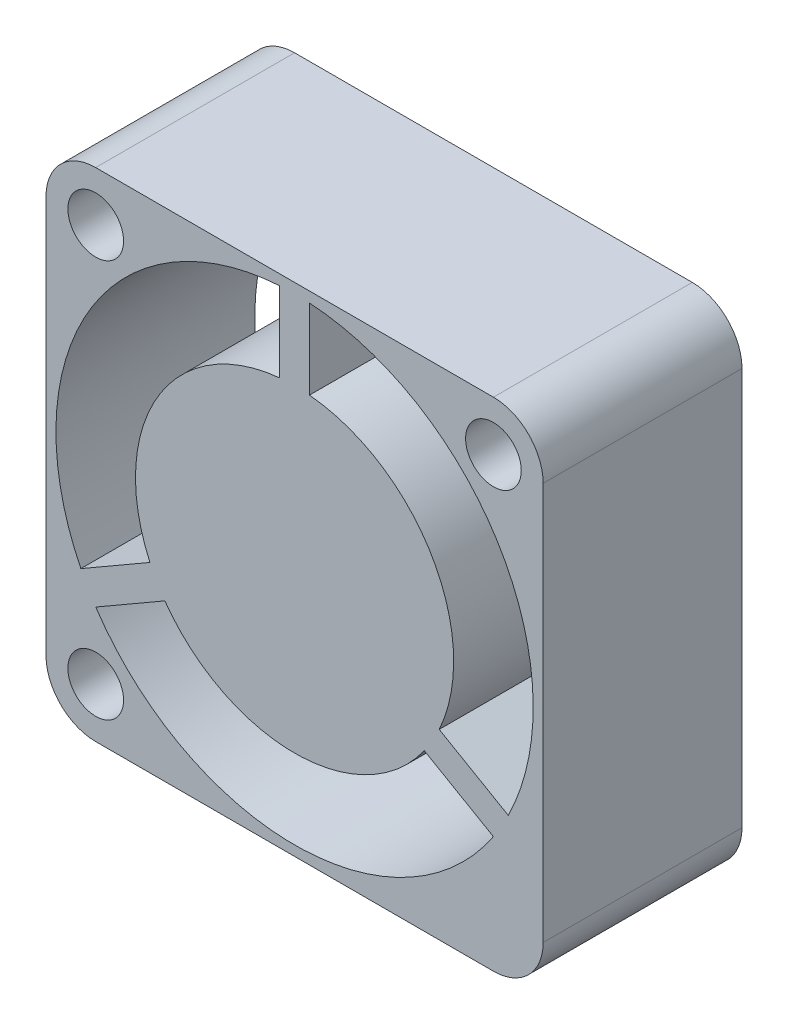
ISO-10303-21;
HEADER;
FILE_DESCRIPTION(('STEP AP214'),'2;1');
FILE_NAME('part.step','',(''),(''),'','','');
FILE_SCHEMA(('AUTOMOTIVE_DESIGN { 1 0 10303 214 1 1 1 1 }'));
ENDSEC;
DATA;
#1=APPLICATION_CONTEXT('core data for automotive mechanical design processes');
#2=APPLICATION_PROTOCOL_DEFINITION('international standard','automotive_design',2000,#1);
#3=PRODUCT_CONTEXT('',#1,'mechanical');
#4=PRODUCT('Part','Part','',(#3));
#5=PRODUCT_RELATED_PRODUCT_CATEGORY('part','',(#4));
#6=PRODUCT_DEFINITION_FORMATION('','',#4);
#7=PRODUCT_DEFINITION_CONTEXT('part definition',#1,'design');
#8=PRODUCT_DEFINITION('design','',#6,#7);
#9=PRODUCT_DEFINITION_SHAPE('','',#8);
#10=(LENGTH_UNIT() NAMED_UNIT(*) SI_UNIT(.MILLI.,.METRE.));
#11=(NAMED_UNIT(*) PLANE_ANGLE_UNIT() SI_UNIT($,.RADIAN.));
#12=(NAMED_UNIT(*) SI_UNIT($,.STERADIAN.) SOLID_ANGLE_UNIT());
#13=UNCERTAINTY_MEASURE_WITH_UNIT(LENGTH_MEASURE(1.E-05),#10,'distance_accuracy_value','');
#14=(GEOMETRIC_REPRESENTATION_CONTEXT(3) GLOBAL_UNCERTAINTY_ASSIGNED_CONTEXT((#13)) GLOBAL_UNIT_ASSIGNED_CONTEXT((#10,
#11,#12)) REPRESENTATION_CONTEXT('',''));
#15=CARTESIAN_POINT('',(0.,0.,0.));
#16=DIRECTION('',(0.,0.,1.));
#17=DIRECTION('',(1.,0.,0.));
#18=AXIS2_PLACEMENT_3D('',#15,#16,#17);
#19=CARTESIAN_POINT('',(12.5,12.5,10.));
#20=DIRECTION('',(0.,0.,-1.));
#21=DIRECTION('',(-1.,0.,0.));
#22=AXIS2_PLACEMENT_3D('',#19,#20,#21);
#23=CYLINDRICAL_SURFACE('',#22,12.);
#24=DIRECTION('',(0.,0.,-1.));
#25=VECTOR('',#24,1.);
#26=CARTESIAN_POINT('',(1.7530124855456,7.16124926933639,10.));
#27=LINE('',#26,#25);
#28=CARTESIAN_POINT('',(1.7530124855456,7.16124926933639,0.));
#29=VERTEX_POINT('',#28);
#30=CARTESIAN_POINT('',(1.7530124855456,7.16124926933639,10.));
#31=VERTEX_POINT('',#30);
#32=EDGE_CURVE('E195',#29,#31,#27,.F.);
#33=ORIENTED_EDGE('',*,*,#32,.F.);
#34=CARTESIAN_POINT('',(12.5,12.5,0.));
#35=DIRECTION('',(0.,0.,1.));
#36=DIRECTION('',(1.,0.,0.));
#37=AXIS2_PLACEMENT_3D('',#34,#35,#36);
#38=CIRCLE('',#37,12.);
#39=CARTESIAN_POINT('',(11.75,24.4765395670035,0.));
#40=VERTEX_POINT('',#39);
#41=EDGE_CURVE('E270',#40,#29,#38,.T.);
#42=ORIENTED_EDGE('',*,*,#41,.F.);
#43=DIRECTION('',(0.,0.,-1.));
#44=VECTOR('',#43,1.);
#45=CARTESIAN_POINT('',(11.75,24.4765395670035,10.));
#46=LINE('',#45,#44);
#47=CARTESIAN_POINT('',(11.75,24.4765395670035,10.));
#48=VERTEX_POINT('',#47);
#49=EDGE_CURVE('E40',#48,#40,#46,.T.);
#50=ORIENTED_EDGE('',*,*,#49,.F.);
#51=CARTESIAN_POINT('',(12.5,12.5,10.));
#52=DIRECTION('',(0.,0.,1.));
#53=DIRECTION('',(1.,0.,0.));
#54=AXIS2_PLACEMENT_3D('',#51,#52,#53);
#55=CIRCLE('',#54,12.);
#56=EDGE_CURVE('E266',#48,#31,#55,.T.);
#57=ORIENTED_EDGE('',*,*,#56,.T.);
#58=EDGE_LOOP('',(#33,#42,#50,#57));
#59=FACE_BOUND('',#58,.T.);
#60=ADVANCED_FACE('F32',(#59),#23,.F.);
#61=CARTESIAN_POINT('',(12.5,12.5,-22.6274169979695));
#62=DIRECTION('',(0.,0.,1.));
#63=DIRECTION('',(1.,0.,0.));
#64=AXIS2_PLACEMENT_3D('',#61,#62,#63);
#65=CYLINDRICAL_SURFACE('',#64,8.);
#66=DIRECTION('',(0.,0.,1.));
#67=VECTOR('',#66,1.);
#68=CARTESIAN_POINT('',(5.22731016933961,9.16713597231971,-5.88228094568846));
#69=LINE('',#68,#67);
#70=CARTESIAN_POINT('',(5.22731016933941,9.16713597231959,0.));
#71=VERTEX_POINT('',#70);
#72=CARTESIAN_POINT('',(5.22731016933941,9.16713597231959,10.));
#73=VERTEX_POINT('',#72);
#74=EDGE_CURVE('E47',#71,#73,#69,.T.);
#75=ORIENTED_EDGE('',*,*,#74,.T.);
#76=CARTESIAN_POINT('',(12.5,12.5,10.));
#77=DIRECTION('',(0.,0.,1.));
#78=DIRECTION('',(1.,0.,0.));
#79=AXIS2_PLACEMENT_3D('',#76,#77,#78);
#80=CIRCLE('',#79,8.);
#81=CARTESIAN_POINT('',(11.75,20.464766161037,10.));
#82=VERTEX_POINT('',#81);
#83=EDGE_CURVE('E179',#82,#73,#80,.T.);
#84=ORIENTED_EDGE('',*,*,#83,.F.);
#85=DIRECTION('',(0.,0.,1.));
#86=VECTOR('',#85,1.);
#87=CARTESIAN_POINT('',(11.75,20.464766161037,-5.88228094568846));
#88=LINE('',#87,#86);
#89=CARTESIAN_POINT('',(11.75,20.464766161037,0.));
#90=VERTEX_POINT('',#89);
#91=EDGE_CURVE('E239',#90,#82,#88,.T.);
#92=ORIENTED_EDGE('',*,*,#91,.F.);
#93=CARTESIAN_POINT('',(12.5,12.5,0.));
#94=DIRECTION('',(0.,0.,-1.));
#95=DIRECTION('',(-1.,0.,0.));
#96=AXIS2_PLACEMENT_3D('',#93,#94,#95);
#97=CIRCLE('',#96,8.);
#98=EDGE_CURVE('E226',#90,#71,#97,.F.);
#99=ORIENTED_EDGE('',*,*,#98,.T.);
#100=EDGE_LOOP('',(#75,#84,#92,#99));
#101=FACE_BOUND('',#100,.T.);
#102=ADVANCED_FACE('F345',(#101),#65,.T.);
#103=DIRECTION('',(0.,0.,-1.));
#104=VECTOR('',#103,1.);
#105=CARTESIAN_POINT('',(2.50301248554563,5.86221116365974,10.));
#106=LINE('',#105,#104);
#107=CARTESIAN_POINT('',(2.50301248554563,5.86221116365974,10.));
#108=VERTEX_POINT('',#107);
#109=CARTESIAN_POINT('',(2.50301248554563,5.86221116365974,0.));
#110=VERTEX_POINT('',#109);
#111=EDGE_CURVE('E55',#108,#110,#106,.T.);
#112=ORIENTED_EDGE('',*,*,#111,.F.);
#113=CARTESIAN_POINT('',(22.4969875144547,5.86221116366016,10.));
#114=VERTEX_POINT('',#113);
#115=EDGE_CURVE('E186',#108,#114,#55,.T.);
#116=ORIENTED_EDGE('',*,*,#115,.T.);
#117=DIRECTION('',(0.,0.,-1.));
#118=VECTOR('',#117,1.);
#119=CARTESIAN_POINT('',(22.4969875144547,5.86221116366017,10.));
#120=LINE('',#119,#118);
#121=CARTESIAN_POINT('',(22.4969875144547,5.86221116366016,0.));
#122=VERTEX_POINT('',#121);
#123=EDGE_CURVE('E222',#122,#114,#120,.F.);
#124=ORIENTED_EDGE('',*,*,#123,.F.);
#125=EDGE_CURVE('E273',#110,#122,#38,.T.);
#126=ORIENTED_EDGE('',*,*,#125,.F.);
#127=EDGE_LOOP('',(#112,#116,#124,#126));
#128=FACE_BOUND('',#127,.T.);
#129=ADVANCED_FACE('F365',(#128),#23,.F.);
#130=DIRECTION('',(0.,0.,1.));
#131=VECTOR('',#130,1.);
#132=CARTESIAN_POINT('',(5.9773101693396,7.86809786664304,-5.88228094568846));
#133=LINE('',#132,#131);
#134=CARTESIAN_POINT('',(5.97731016933945,7.86809786664296,0.));
#135=VERTEX_POINT('',#134);
#136=CARTESIAN_POINT('',(5.9773101693396,7.86809786664304,10.));
#137=VERTEX_POINT('',#136);
#138=EDGE_CURVE('E172',#135,#137,#133,.T.);
#139=ORIENTED_EDGE('',*,*,#138,.F.);
#140=CARTESIAN_POINT('',(19.0226898306609,7.86809786664342,0.));
#141=VERTEX_POINT('',#140);
#142=EDGE_CURVE('E229',#135,#141,#97,.F.);
#143=ORIENTED_EDGE('',*,*,#142,.T.);
#144=DIRECTION('',(0.,0.,1.));
#145=VECTOR('',#144,1.);
#146=CARTESIAN_POINT('',(19.022689830661,7.86809786664334,-5.88228094568846));
#147=LINE('',#146,#145);
#148=CARTESIAN_POINT('',(19.0226898306609,7.86809786664342,10.));
#149=VERTEX_POINT('',#148);
#150=EDGE_CURVE('E175',#141,#149,#147,.T.);
#151=ORIENTED_EDGE('',*,*,#150,.T.);
#152=EDGE_CURVE('E168',#137,#149,#80,.T.);
#153=ORIENTED_EDGE('',*,*,#152,.F.);
#154=EDGE_LOOP('',(#139,#143,#151,#153));
#155=FACE_BOUND('',#154,.T.);
#156=ADVANCED_FACE('F170',(#155),#65,.T.);
#157=CARTESIAN_POINT('',(0.,0.,10.));
#158=DIRECTION('',(0.,0.,-1.));
#159=DIRECTION('',(-1.,0.,0.));
#160=AXIS2_PLACEMENT_3D('',#157,#158,#159);
#161=PLANE('',#160);
#162=ORIENTED_EDGE('',*,*,#115,.F.);
#163=DIRECTION('',(0.866025403784443,0.499999999999992,0.));
#164=VECTOR('',#163,1.);
#165=CARTESIAN_POINT('',(2.04968245269479,5.60048094716158,10.));
#166=LINE('',#165,#164);
#167=EDGE_CURVE('E183',#108,#137,#166,.T.);
#168=ORIENTED_EDGE('',*,*,#167,.T.);
#169=ORIENTED_EDGE('',*,*,#152,.T.);
#170=DIRECTION('',(0.866025403784436,-0.500000000000004,0.));
#171=VECTOR('',#170,1.);
#172=CARTESIAN_POINT('',(22.9503175473058,5.60048094716182,10.));
#173=LINE('',#172,#171);
#174=EDGE_CURVE('E205',#149,#114,#173,.T.);
#175=ORIENTED_EDGE('',*,*,#174,.T.);
#176=EDGE_LOOP('',(#162,#168,#169,#175));
#177=FACE_BOUND('',#176,.T.);
#178=DIRECTION('',(-0.866025403784444,-0.499999999999992,0.));
#179=VECTOR('',#178,1.);
#180=CARTESIAN_POINT('',(1.2996824526948,6.89951905283824,10.));
#181=LINE('',#180,#179);
#182=EDGE_CURVE('E188',#73,#31,#181,.T.);
#183=ORIENTED_EDGE('',*,*,#182,.T.);
#184=ORIENTED_EDGE('',*,*,#56,.F.);
#185=DIRECTION('',(0.,-1.,0.));
#186=VECTOR('',#185,1.);
#187=CARTESIAN_POINT('',(11.75,25.,10.));
#188=LINE('',#187,#186);
#189=EDGE_CURVE('E228',#48,#82,#188,.T.);
#190=ORIENTED_EDGE('',*,*,#189,.T.);
#191=ORIENTED_EDGE('',*,*,#83,.T.);
#192=EDGE_LOOP('',(#183,#184,#190,#191));
#193=FACE_BOUND('',#192,.T.);
#194=DIRECTION('',(-0.866025403784436,0.500000000000004,0.));
#195=VECTOR('',#194,1.);
#196=CARTESIAN_POINT('',(23.7003175473058,6.89951905283848,10.));
#197=LINE('',#196,#195);
#198=CARTESIAN_POINT('',(23.2469875144546,7.16124926933684,10.));
#199=VERTEX_POINT('',#198);
#200=CARTESIAN_POINT('',(19.772689830661,9.16713597232,10.));
#201=VERTEX_POINT('',#200);
#202=EDGE_CURVE('E204',#199,#201,#197,.T.);
#203=ORIENTED_EDGE('',*,*,#202,.T.);
#204=CARTESIAN_POINT('',(13.25,20.464766161037,10.));
#205=VERTEX_POINT('',#204);
#206=EDGE_CURVE('E180',#201,#205,#80,.T.);
#207=ORIENTED_EDGE('',*,*,#206,.T.);
#208=DIRECTION('',(0.,1.,0.));
#209=VECTOR('',#208,1.);
#210=CARTESIAN_POINT('',(13.25,25.,10.));
#211=LINE('',#210,#209);
#212=CARTESIAN_POINT('',(13.25,24.4765395670035,10.));
#213=VERTEX_POINT('',#212);
#214=EDGE_CURVE('E230',#205,#213,#211,.T.);
#215=ORIENTED_EDGE('',*,*,#214,.T.);
#216=EDGE_CURVE('E269',#199,#213,#55,.T.);
#217=ORIENTED_EDGE('',*,*,#216,.F.);
#218=EDGE_LOOP('',(#203,#207,#215,#217));
#219=FACE_BOUND('',#218,.T.);
#220=CARTESIAN_POINT('',(2.5,2.5,10.));
#221=DIRECTION('',(0.,0.,1.));
#222=DIRECTION('',(1.,0.,0.));
#223=AXIS2_PLACEMENT_3D('',#220,#221,#222);
#224=CIRCLE('',#223,1.4);
#225=CARTESIAN_POINT('',(3.9,2.5,10.));
#226=VERTEX_POINT('',#225);
#227=EDGE_CURVE('E254',#226,#226,#224,.T.);
#228=ORIENTED_EDGE('',*,*,#227,.F.);
#229=EDGE_LOOP('',(#228));
#230=FACE_BOUND('',#229,.T.);
#231=DIRECTION('',(-1.,0.,0.));
#232=VECTOR('',#231,1.);
#233=CARTESIAN_POINT('',(0.,25.,10.));
#234=LINE('',#233,#232);
#235=CARTESIAN_POINT('',(22.5,25.,10.));
#236=VERTEX_POINT('',#235);
#237=CARTESIAN_POINT('',(2.5,25.,10.));
#238=VERTEX_POINT('',#237);
#239=EDGE_CURVE('E284',#236,#238,#234,.T.);
#240=ORIENTED_EDGE('',*,*,#239,.T.);
#241=CARTESIAN_POINT('',(2.5,22.5,10.));
#242=DIRECTION('',(0.,0.,-1.));
#243=DIRECTION('',(-1.,0.,0.));
#244=AXIS2_PLACEMENT_3D('',#241,#242,#243);
#245=CIRCLE('',#244,2.5);
#246=CARTESIAN_POINT('',(0.,22.5,10.));
#247=VERTEX_POINT('',#246);
#248=EDGE_CURVE('E321',#238,#247,#245,.F.);
#249=ORIENTED_EDGE('',*,*,#248,.T.);
#250=DIRECTION('',(0.,-1.,0.));
#251=VECTOR('',#250,1.);
#252=CARTESIAN_POINT('',(0.,0.,10.));
#253=LINE('',#252,#251);
#254=CARTESIAN_POINT('',(0.,2.5,10.));
#255=VERTEX_POINT('',#254);
#256=EDGE_CURVE('E274',#247,#255,#253,.T.);
#257=ORIENTED_EDGE('',*,*,#256,.T.);
#258=CARTESIAN_POINT('',(2.5,2.5,10.));
#259=DIRECTION('',(0.,0.,-1.));
#260=DIRECTION('',(-1.,0.,0.));
#261=AXIS2_PLACEMENT_3D('',#258,#259,#260);
#262=CIRCLE('',#261,2.5);
#263=CARTESIAN_POINT('',(2.5,0.,10.));
#264=VERTEX_POINT('',#263);
#265=EDGE_CURVE('E319',#255,#264,#262,.F.);
#266=ORIENTED_EDGE('',*,*,#265,.T.);
#267=DIRECTION('',(1.,0.,0.));
#268=VECTOR('',#267,1.);
#269=CARTESIAN_POINT('',(0.,0.,10.));
#270=LINE('',#269,#268);
#271=CARTESIAN_POINT('',(22.5,0.,10.));
#272=VERTEX_POINT('',#271);
#273=EDGE_CURVE('E277',#264,#272,#270,.T.);
#274=ORIENTED_EDGE('',*,*,#273,.T.);
#275=CARTESIAN_POINT('',(22.5,2.5,10.));
#276=DIRECTION('',(0.,0.,-1.));
#277=DIRECTION('',(-1.,0.,0.));
#278=AXIS2_PLACEMENT_3D('',#275,#276,#277);
#279=CIRCLE('',#278,2.5);
#280=CARTESIAN_POINT('',(25.,2.5,10.));
#281=VERTEX_POINT('',#280);
#282=EDGE_CURVE('E317',#272,#281,#279,.F.);
#283=ORIENTED_EDGE('',*,*,#282,.T.);
#284=DIRECTION('',(0.,1.,0.));
#285=VECTOR('',#284,1.);
#286=CARTESIAN_POINT('',(25.,0.,10.));
#287=LINE('',#286,#285);
#288=CARTESIAN_POINT('',(25.,22.5,10.));
#289=VERTEX_POINT('',#288);
#290=EDGE_CURVE('E281',#281,#289,#287,.T.);
#291=ORIENTED_EDGE('',*,*,#290,.T.);
#292=CARTESIAN_POINT('',(22.5,22.5,10.));
#293=DIRECTION('',(0.,0.,-1.));
#294=DIRECTION('',(-1.,0.,0.));
#295=AXIS2_PLACEMENT_3D('',#292,#293,#294);
#296=CIRCLE('',#295,2.5);
#297=EDGE_CURVE('E315',#289,#236,#296,.F.);
#298=ORIENTED_EDGE('',*,*,#297,.T.);
#299=EDGE_LOOP('',(#240,#249,#257,#266,#274,#283,#291,#298));
#300=FACE_BOUND('',#299,.T.);
#301=CARTESIAN_POINT('',(2.5,22.5,10.));
#302=DIRECTION('',(0.,0.,1.));
#303=DIRECTION('',(1.,0.,0.));
#304=AXIS2_PLACEMENT_3D('',#301,#302,#303);
#305=CIRCLE('',#304,1.4);
#306=CARTESIAN_POINT('',(3.9,22.5,10.));
#307=VERTEX_POINT('',#306);
#308=EDGE_CURVE('E260',#307,#307,#305,.T.);
#309=ORIENTED_EDGE('',*,*,#308,.F.);
#310=EDGE_LOOP('',(#309));
#311=FACE_BOUND('',#310,.T.);
#312=CARTESIAN_POINT('',(22.5,22.5,10.));
#313=DIRECTION('',(0.,0.,1.));
#314=DIRECTION('',(1.,0.,0.));
#315=AXIS2_PLACEMENT_3D('',#312,#313,#314);
#316=CIRCLE('',#315,1.4);
#317=CARTESIAN_POINT('',(23.9,22.5,10.));
#318=VERTEX_POINT('',#317);
#319=EDGE_CURVE('E248',#318,#318,#316,.T.);
#320=ORIENTED_EDGE('',*,*,#319,.F.);
#321=EDGE_LOOP('',(#320));
#322=FACE_BOUND('',#321,.T.);
#323=ADVANCED_FACE('F184',(#177,#193,#219,#230,#300,#311,#322),#161,.F.);
#324=CARTESIAN_POINT('',(0.,0.,0.));
#325=DIRECTION('',(0.,0.,-1.));
#326=DIRECTION('',(-1.,0.,0.));
#327=AXIS2_PLACEMENT_3D('',#324,#325,#326);
#328=PLANE('',#327);
#329=DIRECTION('',(0.866025403784443,0.499999999999992,0.));
#330=VECTOR('',#329,1.);
#331=CARTESIAN_POINT('',(2.04968245269479,5.60048094716158,0.));
#332=LINE('',#331,#330);
#333=EDGE_CURVE('E193',#110,#135,#332,.T.);
#334=ORIENTED_EDGE('',*,*,#333,.F.);
#335=ORIENTED_EDGE('',*,*,#125,.T.);
#336=DIRECTION('',(0.866025403784436,-0.500000000000004,0.));
#337=VECTOR('',#336,1.);
#338=CARTESIAN_POINT('',(22.9503175473058,5.60048094716182,0.));
#339=LINE('',#338,#337);
#340=EDGE_CURVE('E213',#141,#122,#339,.T.);
#341=ORIENTED_EDGE('',*,*,#340,.F.);
#342=ORIENTED_EDGE('',*,*,#142,.F.);
#343=EDGE_LOOP('',(#334,#335,#341,#342));
#344=FACE_BOUND('',#343,.T.);
#345=ORIENTED_EDGE('',*,*,#41,.T.);
#346=DIRECTION('',(-0.866025403784444,-0.499999999999992,0.));
#347=VECTOR('',#346,1.);
#348=CARTESIAN_POINT('',(1.2996824526948,6.89951905283824,0.));
#349=LINE('',#348,#347);
#350=EDGE_CURVE('E197',#71,#29,#349,.T.);
#351=ORIENTED_EDGE('',*,*,#350,.F.);
#352=ORIENTED_EDGE('',*,*,#98,.F.);
#353=DIRECTION('',(0.,-1.,0.));
#354=VECTOR('',#353,1.);
#355=CARTESIAN_POINT('',(11.75,25.,0.));
#356=LINE('',#355,#354);
#357=EDGE_CURVE('E236',#40,#90,#356,.T.);
#358=ORIENTED_EDGE('',*,*,#357,.F.);
#359=EDGE_LOOP('',(#345,#351,#352,#358));
#360=FACE_BOUND('',#359,.T.);
#361=CARTESIAN_POINT('',(19.7726898306608,9.16713597232011,0.));
#362=VERTEX_POINT('',#361);
#363=CARTESIAN_POINT('',(13.25,20.464766161037,0.));
#364=VERTEX_POINT('',#363);
#365=EDGE_CURVE('E225',#362,#364,#97,.F.);
#366=ORIENTED_EDGE('',*,*,#365,.F.);
#367=DIRECTION('',(-0.866025403784436,0.500000000000004,0.));
#368=VECTOR('',#367,1.);
#369=CARTESIAN_POINT('',(23.7003175473058,6.89951905283848,0.));
#370=LINE('',#369,#368);
#371=CARTESIAN_POINT('',(23.2469875144546,7.16124926933685,0.));
#372=VERTEX_POINT('',#371);
#373=EDGE_CURVE('E209',#372,#362,#370,.T.);
#374=ORIENTED_EDGE('',*,*,#373,.F.);
#375=CARTESIAN_POINT('',(13.25,24.4765395670035,0.));
#376=VERTEX_POINT('',#375);
#377=EDGE_CURVE('E263',#372,#376,#38,.T.);
#378=ORIENTED_EDGE('',*,*,#377,.T.);
#379=DIRECTION('',(0.,1.,0.));
#380=VECTOR('',#379,1.);
#381=CARTESIAN_POINT('',(13.25,25.,0.));
#382=LINE('',#381,#380);
#383=EDGE_CURVE('E240',#364,#376,#382,.T.);
#384=ORIENTED_EDGE('',*,*,#383,.F.);
#385=EDGE_LOOP('',(#366,#374,#378,#384));
#386=FACE_BOUND('',#385,.T.);
#387=CARTESIAN_POINT('',(2.5,22.5,0.));
#388=DIRECTION('',(0.,0.,-1.));
#389=DIRECTION('',(-1.,0.,0.));
#390=AXIS2_PLACEMENT_3D('',#387,#388,#389);
#391=CIRCLE('',#390,2.5);
#392=CARTESIAN_POINT('',(0.,22.5,0.));
#393=VERTEX_POINT('',#392);
#394=CARTESIAN_POINT('',(2.5,25.,0.));
#395=VERTEX_POINT('',#394);
#396=EDGE_CURVE('E306',#393,#395,#391,.T.);
#397=ORIENTED_EDGE('',*,*,#396,.T.);
#398=DIRECTION('',(-1.,0.,0.));
#399=VECTOR('',#398,1.);
#400=CARTESIAN_POINT('',(0.,25.,0.));
#401=LINE('',#400,#399);
#402=CARTESIAN_POINT('',(22.5,25.,0.));
#403=VERTEX_POINT('',#402);
#404=EDGE_CURVE('E278',#403,#395,#401,.T.);
#405=ORIENTED_EDGE('',*,*,#404,.F.);
#406=CARTESIAN_POINT('',(22.5,22.5,0.));
#407=DIRECTION('',(0.,0.,-1.));
#408=DIRECTION('',(-1.,0.,0.));
#409=AXIS2_PLACEMENT_3D('',#406,#407,#408);
#410=CIRCLE('',#409,2.5);
#411=CARTESIAN_POINT('',(25.,22.5,0.));
#412=VERTEX_POINT('',#411);
#413=EDGE_CURVE('E300',#403,#412,#410,.T.);
#414=ORIENTED_EDGE('',*,*,#413,.T.);
#415=DIRECTION('',(0.,1.,0.));
#416=VECTOR('',#415,1.);
#417=CARTESIAN_POINT('',(25.,0.,0.));
#418=LINE('',#417,#416);
#419=CARTESIAN_POINT('',(25.,2.5,0.));
#420=VERTEX_POINT('',#419);
#421=EDGE_CURVE('E292',#420,#412,#418,.T.);
#422=ORIENTED_EDGE('',*,*,#421,.F.);
#423=CARTESIAN_POINT('',(22.5,2.5,0.));
#424=DIRECTION('',(0.,0.,-1.));
#425=DIRECTION('',(-1.,0.,0.));
#426=AXIS2_PLACEMENT_3D('',#423,#424,#425);
#427=CIRCLE('',#426,2.5);
#428=CARTESIAN_POINT('',(22.5,0.,0.));
#429=VERTEX_POINT('',#428);
#430=EDGE_CURVE('E302',#420,#429,#427,.T.);
#431=ORIENTED_EDGE('',*,*,#430,.T.);
#432=DIRECTION('',(1.,0.,0.));
#433=VECTOR('',#432,1.);
#434=CARTESIAN_POINT('',(0.,0.,0.));
#435=LINE('',#434,#433);
#436=CARTESIAN_POINT('',(2.5,0.,0.));
#437=VERTEX_POINT('',#436);
#438=EDGE_CURVE('E289',#437,#429,#435,.T.);
#439=ORIENTED_EDGE('',*,*,#438,.F.);
#440=CARTESIAN_POINT('',(2.5,2.5,0.));
#441=DIRECTION('',(0.,0.,-1.));
#442=DIRECTION('',(-1.,0.,0.));
#443=AXIS2_PLACEMENT_3D('',#440,#441,#442);
#444=CIRCLE('',#443,2.5);
#445=CARTESIAN_POINT('',(0.,2.5,0.));
#446=VERTEX_POINT('',#445);
#447=EDGE_CURVE('E304',#437,#446,#444,.T.);
#448=ORIENTED_EDGE('',*,*,#447,.T.);
#449=DIRECTION('',(0.,-1.,0.));
#450=VECTOR('',#449,1.);
#451=CARTESIAN_POINT('',(0.,0.,0.));
#452=LINE('',#451,#450);
#453=EDGE_CURVE('E268',#393,#446,#452,.T.);
#454=ORIENTED_EDGE('',*,*,#453,.F.);
#455=EDGE_LOOP('',(#397,#405,#414,#422,#431,#439,#448,#454));
#456=FACE_BOUND('',#455,.T.);
#457=CARTESIAN_POINT('',(2.5,2.5,0.));
#458=DIRECTION('',(0.,0.,1.));
#459=DIRECTION('',(1.,0.,0.));
#460=AXIS2_PLACEMENT_3D('',#457,#458,#459);
#461=CIRCLE('',#460,1.4);
#462=CARTESIAN_POINT('',(3.9,2.5,0.));
#463=VERTEX_POINT('',#462);
#464=EDGE_CURVE('E251',#463,#463,#461,.T.);
#465=ORIENTED_EDGE('',*,*,#464,.T.);
#466=EDGE_LOOP('',(#465));
#467=FACE_BOUND('',#466,.T.);
#468=CARTESIAN_POINT('',(2.5,22.5,0.));
#469=DIRECTION('',(0.,0.,1.));
#470=DIRECTION('',(1.,0.,0.));
#471=AXIS2_PLACEMENT_3D('',#468,#469,#470);
#472=CIRCLE('',#471,1.4);
#473=CARTESIAN_POINT('',(3.9,22.5,0.));
#474=VERTEX_POINT('',#473);
#475=EDGE_CURVE('E257',#474,#474,#472,.T.);
#476=ORIENTED_EDGE('',*,*,#475,.T.);
#477=EDGE_LOOP('',(#476));
#478=FACE_BOUND('',#477,.T.);
#479=CARTESIAN_POINT('',(22.5,22.5,0.));
#480=DIRECTION('',(0.,0.,1.));
#481=DIRECTION('',(1.,0.,0.));
#482=AXIS2_PLACEMENT_3D('',#479,#480,#481);
#483=CIRCLE('',#482,1.4);
#484=CARTESIAN_POINT('',(23.9,22.5,0.));
#485=VERTEX_POINT('',#484);
#486=EDGE_CURVE('E247',#485,#485,#483,.T.);
#487=ORIENTED_EDGE('',*,*,#486,.T.);
#488=EDGE_LOOP('',(#487));
#489=FACE_BOUND('',#488,.T.);
#490=ADVANCED_FACE('F341',(#344,#360,#386,#456,#467,#478,#489),#328,.T.);
#491=CARTESIAN_POINT('',(0.,0.,10.));
#492=DIRECTION('',(1.,0.,0.));
#493=DIRECTION('',(0.,0.,-1.));
#494=AXIS2_PLACEMENT_3D('',#491,#492,#493);
#495=PLANE('',#494);
#496=ORIENTED_EDGE('',*,*,#256,.F.);
#497=DIRECTION('',(0.,0.,-1.));
#498=VECTOR('',#497,1.);
#499=CARTESIAN_POINT('',(0.,22.5,10.));
#500=LINE('',#499,#498);
#501=EDGE_CURVE('E297',#247,#393,#500,.T.);
#502=ORIENTED_EDGE('',*,*,#501,.T.);
#503=ORIENTED_EDGE('',*,*,#453,.T.);
#504=DIRECTION('',(0.,0.,-1.));
#505=VECTOR('',#504,1.);
#506=CARTESIAN_POINT('',(0.,2.5,10.));
#507=LINE('',#506,#505);
#508=EDGE_CURVE('E286',#446,#255,#507,.F.);
#509=ORIENTED_EDGE('',*,*,#508,.T.);
#510=EDGE_LOOP('',(#496,#502,#503,#509));
#511=FACE_BOUND('',#510,.T.);
#512=ADVANCED_FACE('F430',(#511),#495,.F.);
#513=CARTESIAN_POINT('',(0.,0.,10.));
#514=DIRECTION('',(0.,1.,0.));
#515=DIRECTION('',(0.,0.,1.));
#516=AXIS2_PLACEMENT_3D('',#513,#514,#515);
#517=PLANE('',#516);
#518=ORIENTED_EDGE('',*,*,#273,.F.);
#519=DIRECTION('',(0.,0.,-1.));
#520=VECTOR('',#519,1.);
#521=CARTESIAN_POINT('',(2.5,0.,10.));
#522=LINE('',#521,#520);
#523=EDGE_CURVE('E325',#264,#437,#522,.T.);
#524=ORIENTED_EDGE('',*,*,#523,.T.);
#525=ORIENTED_EDGE('',*,*,#438,.T.);
#526=DIRECTION('',(0.,0.,-1.));
#527=VECTOR('',#526,1.);
#528=CARTESIAN_POINT('',(22.5,0.,10.));
#529=LINE('',#528,#527);
#530=EDGE_CURVE('E323',#429,#272,#529,.F.);
#531=ORIENTED_EDGE('',*,*,#530,.T.);
#532=EDGE_LOOP('',(#518,#524,#525,#531));
#533=FACE_BOUND('',#532,.T.);
#534=ADVANCED_FACE('F441',(#533),#517,.F.);
#535=CARTESIAN_POINT('',(25.,0.,10.));
#536=DIRECTION('',(-1.,0.,0.));
#537=DIRECTION('',(0.,0.,1.));
#538=AXIS2_PLACEMENT_3D('',#535,#536,#537);
#539=PLANE('',#538);
#540=ORIENTED_EDGE('',*,*,#290,.F.);
#541=DIRECTION('',(0.,0.,-1.));
#542=VECTOR('',#541,1.);
#543=CARTESIAN_POINT('',(25.,2.5,10.));
#544=LINE('',#543,#542);
#545=EDGE_CURVE('E330',#281,#420,#544,.T.);
#546=ORIENTED_EDGE('',*,*,#545,.T.);
#547=ORIENTED_EDGE('',*,*,#421,.T.);
#548=DIRECTION('',(0.,0.,-1.));
#549=VECTOR('',#548,1.);
#550=CARTESIAN_POINT('',(25.,22.5,10.));
#551=LINE('',#550,#549);
#552=EDGE_CURVE('E328',#412,#289,#551,.F.);
#553=ORIENTED_EDGE('',*,*,#552,.T.);
#554=EDGE_LOOP('',(#540,#546,#547,#553));
#555=FACE_BOUND('',#554,.T.);
#556=ADVANCED_FACE('F385',(#555),#539,.F.);
#557=CARTESIAN_POINT('',(0.,25.,10.));
#558=DIRECTION('',(0.,-1.,0.));
#559=DIRECTION('',(0.,0.,-1.));
#560=AXIS2_PLACEMENT_3D('',#557,#558,#559);
#561=PLANE('',#560);
#562=DIRECTION('',(0.,0.,-1.));
#563=VECTOR('',#562,1.);
#564=CARTESIAN_POINT('',(2.5,25.,10.));
#565=LINE('',#564,#563);
#566=EDGE_CURVE('E312',#395,#238,#565,.F.);
#567=ORIENTED_EDGE('',*,*,#566,.T.);
#568=ORIENTED_EDGE('',*,*,#239,.F.);
#569=DIRECTION('',(0.,0.,-1.));
#570=VECTOR('',#569,1.);
#571=CARTESIAN_POINT('',(22.5,25.,10.));
#572=LINE('',#571,#570);
#573=EDGE_CURVE('E309',#236,#403,#572,.T.);
#574=ORIENTED_EDGE('',*,*,#573,.T.);
#575=ORIENTED_EDGE('',*,*,#404,.T.);
#576=EDGE_LOOP('',(#567,#568,#574,#575));
#577=FACE_BOUND('',#576,.T.);
#578=ADVANCED_FACE('F377',(#577),#561,.F.);
#579=DIRECTION('',(0.,0.,-1.));
#580=VECTOR('',#579,1.);
#581=CARTESIAN_POINT('',(23.2469875144546,7.16124926933684,10.));
#582=LINE('',#581,#580);
#583=EDGE_CURVE('E219',#199,#372,#582,.T.);
#584=ORIENTED_EDGE('',*,*,#583,.F.);
#585=ORIENTED_EDGE('',*,*,#216,.T.);
#586=DIRECTION('',(0.,0.,-1.));
#587=VECTOR('',#586,1.);
#588=CARTESIAN_POINT('',(13.25,24.4765395670035,10.));
#589=LINE('',#588,#587);
#590=EDGE_CURVE('E11',#376,#213,#589,.F.);
#591=ORIENTED_EDGE('',*,*,#590,.F.);
#592=ORIENTED_EDGE('',*,*,#377,.F.);
#593=EDGE_LOOP('',(#584,#585,#591,#592));
#594=FACE_BOUND('',#593,.T.);
#595=ADVANCED_FACE('F366',(#594),#23,.F.);
#596=CARTESIAN_POINT('',(2.5,22.5,10.));
#597=DIRECTION('',(0.,0.,-1.));
#598=DIRECTION('',(-1.,0.,0.));
#599=AXIS2_PLACEMENT_3D('',#596,#597,#598);
#600=CYLINDRICAL_SURFACE('',#599,1.4);
#601=ORIENTED_EDGE('',*,*,#308,.T.);
#602=EDGE_LOOP('',(#601));
#603=FACE_BOUND('',#602,.T.);
#604=ORIENTED_EDGE('',*,*,#475,.F.);
#605=EDGE_LOOP('',(#604));
#606=FACE_BOUND('',#605,.T.);
#607=ADVANCED_FACE('F376',(#603,#606),#600,.F.);
#608=CARTESIAN_POINT('',(2.5,2.5,10.));
#609=DIRECTION('',(0.,0.,-1.));
#610=DIRECTION('',(-1.,0.,0.));
#611=AXIS2_PLACEMENT_3D('',#608,#609,#610);
#612=CYLINDRICAL_SURFACE('',#611,1.4);
#613=ORIENTED_EDGE('',*,*,#227,.T.);
#614=EDGE_LOOP('',(#613));
#615=FACE_BOUND('',#614,.T.);
#616=ORIENTED_EDGE('',*,*,#464,.F.);
#617=EDGE_LOOP('',(#616));
#618=FACE_BOUND('',#617,.T.);
#619=ADVANCED_FACE('F383',(#615,#618),#612,.F.);
#620=CARTESIAN_POINT('',(22.5,22.5,10.));
#621=DIRECTION('',(0.,0.,-1.));
#622=DIRECTION('',(-1.,0.,0.));
#623=AXIS2_PLACEMENT_3D('',#620,#621,#622);
#624=CYLINDRICAL_SURFACE('',#623,1.4);
#625=ORIENTED_EDGE('',*,*,#319,.T.);
#626=EDGE_LOOP('',(#625));
#627=FACE_BOUND('',#626,.T.);
#628=ORIENTED_EDGE('',*,*,#486,.F.);
#629=EDGE_LOOP('',(#628));
#630=FACE_BOUND('',#629,.T.);
#631=ADVANCED_FACE('F415',(#627,#630),#624,.F.);
#632=CARTESIAN_POINT('',(2.5,22.5,10.));
#633=DIRECTION('',(0.,0.,-1.));
#634=DIRECTION('',(-1.,0.,0.));
#635=AXIS2_PLACEMENT_3D('',#632,#633,#634);
#636=CYLINDRICAL_SURFACE('',#635,2.5);
#637=ORIENTED_EDGE('',*,*,#248,.F.);
#638=ORIENTED_EDGE('',*,*,#566,.F.);
#639=ORIENTED_EDGE('',*,*,#396,.F.);
#640=ORIENTED_EDGE('',*,*,#501,.F.);
#641=EDGE_LOOP('',(#637,#638,#639,#640));
#642=FACE_BOUND('',#641,.T.);
#643=ADVANCED_FACE('F418',(#642),#636,.T.);
#644=CARTESIAN_POINT('',(2.5,2.5,10.));
#645=DIRECTION('',(0.,0.,-1.));
#646=DIRECTION('',(-1.,0.,0.));
#647=AXIS2_PLACEMENT_3D('',#644,#645,#646);
#648=CYLINDRICAL_SURFACE('',#647,2.5);
#649=ORIENTED_EDGE('',*,*,#265,.F.);
#650=ORIENTED_EDGE('',*,*,#508,.F.);
#651=ORIENTED_EDGE('',*,*,#447,.F.);
#652=ORIENTED_EDGE('',*,*,#523,.F.);
#653=EDGE_LOOP('',(#649,#650,#651,#652));
#654=FACE_BOUND('',#653,.T.);
#655=ADVANCED_FACE('F453',(#654),#648,.T.);
#656=CARTESIAN_POINT('',(22.5,2.5,10.));
#657=DIRECTION('',(0.,0.,-1.));
#658=DIRECTION('',(-1.,0.,0.));
#659=AXIS2_PLACEMENT_3D('',#656,#657,#658);
#660=CYLINDRICAL_SURFACE('',#659,2.5);
#661=ORIENTED_EDGE('',*,*,#282,.F.);
#662=ORIENTED_EDGE('',*,*,#530,.F.);
#663=ORIENTED_EDGE('',*,*,#430,.F.);
#664=ORIENTED_EDGE('',*,*,#545,.F.);
#665=EDGE_LOOP('',(#661,#662,#663,#664));
#666=FACE_BOUND('',#665,.T.);
#667=ADVANCED_FACE('F412',(#666),#660,.T.);
#668=CARTESIAN_POINT('',(22.5,22.5,10.));
#669=DIRECTION('',(0.,0.,-1.));
#670=DIRECTION('',(-1.,0.,0.));
#671=AXIS2_PLACEMENT_3D('',#668,#669,#670);
#672=CYLINDRICAL_SURFACE('',#671,2.5);
#673=ORIENTED_EDGE('',*,*,#297,.F.);
#674=ORIENTED_EDGE('',*,*,#552,.F.);
#675=ORIENTED_EDGE('',*,*,#413,.F.);
#676=ORIENTED_EDGE('',*,*,#573,.F.);
#677=EDGE_LOOP('',(#673,#674,#675,#676));
#678=FACE_BOUND('',#677,.T.);
#679=ADVANCED_FACE('F34',(#678),#672,.T.);
#680=CARTESIAN_POINT('',(13.25,25.,-5.88228094568846));
#681=DIRECTION('',(1.,0.,0.));
#682=DIRECTION('',(0.,0.,-1.));
#683=AXIS2_PLACEMENT_3D('',#680,#681,#682);
#684=PLANE('',#683);
#685=ORIENTED_EDGE('',*,*,#383,.T.);
#686=ORIENTED_EDGE('',*,*,#590,.T.);
#687=ORIENTED_EDGE('',*,*,#214,.F.);
#688=DIRECTION('',(0.,0.,1.));
#689=VECTOR('',#688,1.);
#690=CARTESIAN_POINT('',(13.25,20.464766161037,-5.88228094568846));
#691=LINE('',#690,#689);
#692=EDGE_CURVE('E233',#364,#205,#691,.T.);
#693=ORIENTED_EDGE('',*,*,#692,.F.);
#694=EDGE_LOOP('',(#685,#686,#687,#693));
#695=FACE_BOUND('',#694,.T.);
#696=ADVANCED_FACE('F404',(#695),#684,.T.);
#697=CARTESIAN_POINT('',(11.75,25.,-5.88228094568846));
#698=DIRECTION('',(-1.,0.,0.));
#699=DIRECTION('',(0.,-1.,0.));
#700=AXIS2_PLACEMENT_3D('',#697,#698,#699);
#701=PLANE('',#700);
#702=ORIENTED_EDGE('',*,*,#189,.F.);
#703=ORIENTED_EDGE('',*,*,#49,.T.);
#704=ORIENTED_EDGE('',*,*,#357,.T.);
#705=ORIENTED_EDGE('',*,*,#91,.T.);
#706=EDGE_LOOP('',(#702,#703,#704,#705));
#707=FACE_BOUND('',#706,.T.);
#708=ADVANCED_FACE('F336',(#707),#701,.T.);
#709=DIRECTION('',(0.,0.,1.));
#710=VECTOR('',#709,1.);
#711=CARTESIAN_POINT('',(19.772689830661,9.16713597232,-5.88228094568846));
#712=LINE('',#711,#710);
#713=EDGE_CURVE('E212',#362,#201,#712,.T.);
#714=ORIENTED_EDGE('',*,*,#713,.F.);
#715=ORIENTED_EDGE('',*,*,#365,.T.);
#716=ORIENTED_EDGE('',*,*,#692,.T.);
#717=ORIENTED_EDGE('',*,*,#206,.F.);
#718=EDGE_LOOP('',(#714,#715,#716,#717));
#719=FACE_BOUND('',#718,.T.);
#720=ADVANCED_FACE('F371',(#719),#65,.T.);
#721=CARTESIAN_POINT('',(22.9503175473058,5.60048094716182,-5.88228094568846));
#722=DIRECTION('',(-0.500000000000004,-0.866025403784436,0.));
#723=DIRECTION('',(0.866025403784436,-0.500000000000004,0.));
#724=AXIS2_PLACEMENT_3D('',#721,#722,#723);
#725=PLANE('',#724);
#726=ORIENTED_EDGE('',*,*,#340,.T.);
#727=ORIENTED_EDGE('',*,*,#123,.T.);
#728=ORIENTED_EDGE('',*,*,#174,.F.);
#729=ORIENTED_EDGE('',*,*,#150,.F.);
#730=EDGE_LOOP('',(#726,#727,#728,#729));
#731=FACE_BOUND('',#730,.T.);
#732=ADVANCED_FACE('F360',(#731),#725,.T.);
#733=CARTESIAN_POINT('',(23.7003175473058,6.89951905283848,-5.88228094568846));
#734=DIRECTION('',(0.500000000000004,0.866025403784436,0.));
#735=DIRECTION('',(-0.866025403784436,0.500000000000004,0.));
#736=AXIS2_PLACEMENT_3D('',#733,#734,#735);
#737=PLANE('',#736);
#738=ORIENTED_EDGE('',*,*,#202,.F.);
#739=ORIENTED_EDGE('',*,*,#583,.T.);
#740=ORIENTED_EDGE('',*,*,#373,.T.);
#741=ORIENTED_EDGE('',*,*,#713,.T.);
#742=EDGE_LOOP('',(#738,#739,#740,#741));
#743=FACE_BOUND('',#742,.T.);
#744=ADVANCED_FACE('F353',(#743),#737,.T.);
#745=CARTESIAN_POINT('',(1.2996824526948,6.89951905283824,-5.88228094568846));
#746=DIRECTION('',(-0.499999999999992,0.866025403784443,0.));
#747=DIRECTION('',(-0.866025403784444,-0.499999999999992,0.));
#748=AXIS2_PLACEMENT_3D('',#745,#746,#747);
#749=PLANE('',#748);
#750=ORIENTED_EDGE('',*,*,#350,.T.);
#751=ORIENTED_EDGE('',*,*,#32,.T.);
#752=ORIENTED_EDGE('',*,*,#182,.F.);
#753=ORIENTED_EDGE('',*,*,#74,.F.);
#754=EDGE_LOOP('',(#750,#751,#752,#753));
#755=FACE_BOUND('',#754,.T.);
#756=ADVANCED_FACE('F350',(#755),#749,.T.);
#757=CARTESIAN_POINT('',(2.04968245269479,5.60048094716158,-5.88228094568846));
#758=DIRECTION('',(0.499999999999992,-0.866025403784443,0.));
#759=DIRECTION('',(0.866025403784443,0.499999999999992,0.));
#760=AXIS2_PLACEMENT_3D('',#757,#758,#759);
#761=PLANE('',#760);
#762=ORIENTED_EDGE('',*,*,#167,.F.);
#763=ORIENTED_EDGE('',*,*,#111,.T.);
#764=ORIENTED_EDGE('',*,*,#333,.T.);
#765=ORIENTED_EDGE('',*,*,#138,.T.);
#766=EDGE_LOOP('',(#762,#763,#764,#765));
#767=FACE_BOUND('',#766,.T.);
#768=ADVANCED_FACE('F191',(#767),#761,.T.);
#769=CLOSED_SHELL('',(#60,#102,#129,#156,#323,#490,#512,#534,#556,#578,#595,#607,#619,#631,#643,
#655,#667,#679,#696,#708,#720,#732,#744,#756,#768));
#770=MANIFOLD_SOLID_BREP('B2',#769);
#771=ADVANCED_BREP_SHAPE_REPRESENTATION('',(#18,#770),#14);
#772=SHAPE_DEFINITION_REPRESENTATION(#9,#771);
ENDSEC;
END-ISO-10303-21;
